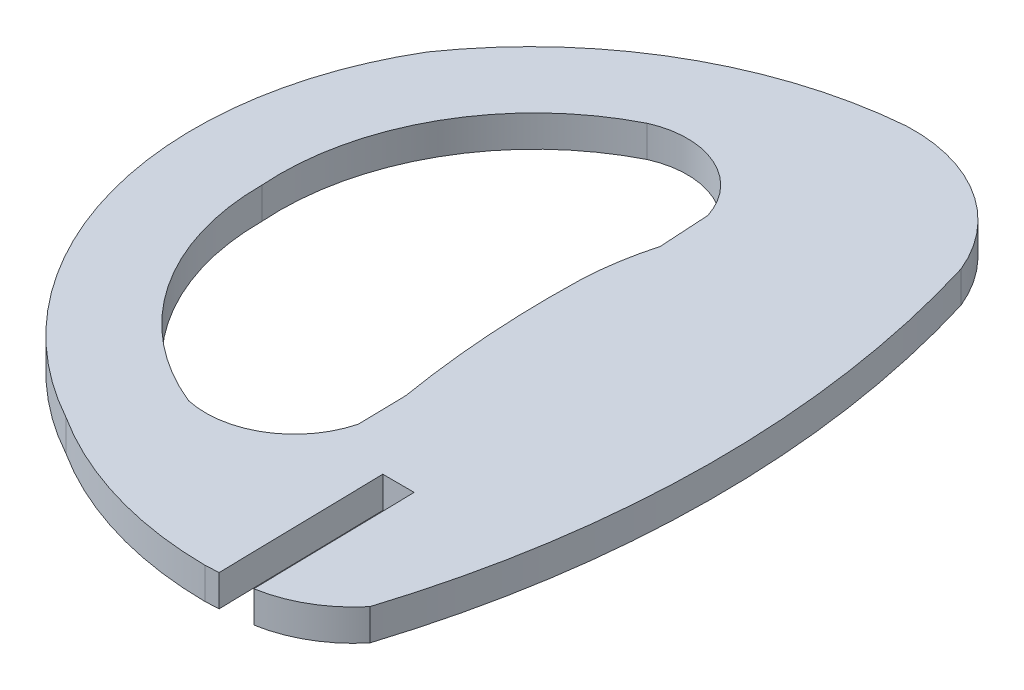
ISO-10303-21;
HEADER;
FILE_DESCRIPTION(('STEP AP214'),'2;1');
FILE_NAME('part.step','',(''),(''),'','','');
FILE_SCHEMA(('AUTOMOTIVE_DESIGN { 1 0 10303 214 1 1 1 1 }'));
ENDSEC;
DATA;
#1=APPLICATION_CONTEXT('core data for automotive mechanical design processes');
#2=APPLICATION_PROTOCOL_DEFINITION('international standard','automotive_design',2000,#1);
#3=PRODUCT_CONTEXT('',#1,'mechanical');
#4=PRODUCT('Part','Part','',(#3));
#5=PRODUCT_RELATED_PRODUCT_CATEGORY('part','',(#4));
#6=PRODUCT_DEFINITION_FORMATION('','',#4);
#7=PRODUCT_DEFINITION_CONTEXT('part definition',#1,'design');
#8=PRODUCT_DEFINITION('design','',#6,#7);
#9=PRODUCT_DEFINITION_SHAPE('','',#8);
#10=(LENGTH_UNIT() NAMED_UNIT(*) SI_UNIT(.MILLI.,.METRE.));
#11=(NAMED_UNIT(*) PLANE_ANGLE_UNIT() SI_UNIT($,.RADIAN.));
#12=(NAMED_UNIT(*) SI_UNIT($,.STERADIAN.) SOLID_ANGLE_UNIT());
#13=UNCERTAINTY_MEASURE_WITH_UNIT(LENGTH_MEASURE(1.E-05),#10,'distance_accuracy_value','');
#14=(GEOMETRIC_REPRESENTATION_CONTEXT(3) GLOBAL_UNCERTAINTY_ASSIGNED_CONTEXT((#13)) GLOBAL_UNIT_ASSIGNED_CONTEXT((#10,
#11,#12)) REPRESENTATION_CONTEXT('',''));
#15=CARTESIAN_POINT('',(0.,0.,0.));
#16=DIRECTION('',(0.,0.,1.));
#17=DIRECTION('',(1.,0.,0.));
#18=AXIS2_PLACEMENT_3D('',#15,#16,#17);
#19=CARTESIAN_POINT('',(-169.11361387481,2.,-647.611887756789));
#20=DIRECTION('',(0.,-1.,0.));
#21=DIRECTION('',(0.,0.,-1.));
#22=AXIS2_PLACEMENT_3D('',#19,#20,#21);
#23=CYLINDRICAL_SURFACE('',#22,7.77888442019999);
#24=CARTESIAN_POINT('',(-169.11361387481,0.,-647.611887756789));
#25=DIRECTION('',(0.,1.,0.));
#26=DIRECTION('',(0.,0.,1.));
#27=AXIS2_PLACEMENT_3D('',#24,#25,#26);
#28=CIRCLE('',#27,7.77888442019999);
#29=CARTESIAN_POINT('',(-167.8,0.,-639.94472));
#30=VERTEX_POINT('',#29);
#31=CARTESIAN_POINT('',(-163.118640000019,0.,-642.654940000013));
#32=VERTEX_POINT('',#31);
#33=EDGE_CURVE('E262',#30,#32,#28,.T.);
#34=ORIENTED_EDGE('',*,*,#33,.T.);
#35=DIRECTION('',(0.,-1.,0.));
#36=VECTOR('',#35,1.);
#37=CARTESIAN_POINT('',(-163.118640000019,2.,-642.654940000013));
#38=LINE('',#37,#36);
#39=CARTESIAN_POINT('',(-163.118640000019,2.,-642.654940000013));
#40=VERTEX_POINT('',#39);
#41=EDGE_CURVE('E288',#40,#32,#38,.T.);
#42=ORIENTED_EDGE('',*,*,#41,.F.);
#43=CARTESIAN_POINT('',(-169.11361387481,2.,-647.611887756789));
#44=DIRECTION('',(0.,1.,0.));
#45=DIRECTION('',(0.,0.,1.));
#46=AXIS2_PLACEMENT_3D('',#43,#44,#45);
#47=CIRCLE('',#46,7.77888442019999);
#48=CARTESIAN_POINT('',(-167.8,2.,-639.94472));
#49=VERTEX_POINT('',#48);
#50=EDGE_CURVE('E223',#49,#40,#47,.T.);
#51=ORIENTED_EDGE('',*,*,#50,.F.);
#52=DIRECTION('',(0.,-1.,0.));
#53=VECTOR('',#52,1.);
#54=CARTESIAN_POINT('',(-167.8,2.,-639.94472));
#55=LINE('',#54,#53);
#56=EDGE_CURVE('E246',#49,#30,#55,.T.);
#57=ORIENTED_EDGE('',*,*,#56,.T.);
#58=EDGE_LOOP('',(#34,#42,#51,#57));
#59=FACE_BOUND('',#58,.T.);
#60=ADVANCED_FACE('F37',(#59),#23,.T.);
#61=CARTESIAN_POINT('',(-223.341929986351,2.,-661.677782661367));
#62=DIRECTION('',(0.,-1.,0.));
#63=DIRECTION('',(0.,0.,-1.));
#64=AXIS2_PLACEMENT_3D('',#61,#62,#63);
#65=CYLINDRICAL_SURFACE('',#64,63.1562601782);
#66=CARTESIAN_POINT('',(-223.341929986351,0.,-661.677782661367));
#67=DIRECTION('',(0.,1.,0.));
#68=DIRECTION('',(0.,0.,1.));
#69=AXIS2_PLACEMENT_3D('',#66,#67,#68);
#70=CIRCLE('',#69,63.1562601782);
#71=CARTESIAN_POINT('',(-162.926399999944,0.,-680.080960000024));
#72=VERTEX_POINT('',#71);
#73=EDGE_CURVE('E260',#32,#72,#70,.T.);
#74=ORIENTED_EDGE('',*,*,#73,.T.);
#75=DIRECTION('',(0.,-1.,0.));
#76=VECTOR('',#75,1.);
#77=CARTESIAN_POINT('',(-162.926399999944,2.,-680.080960000024));
#78=LINE('',#77,#76);
#79=CARTESIAN_POINT('',(-162.926399999944,2.,-680.080960000024));
#80=VERTEX_POINT('',#79);
#81=EDGE_CURVE('E291',#80,#72,#78,.T.);
#82=ORIENTED_EDGE('',*,*,#81,.F.);
#83=CARTESIAN_POINT('',(-223.341929986351,2.,-661.677782661367));
#84=DIRECTION('',(0.,1.,0.));
#85=DIRECTION('',(0.,0.,1.));
#86=AXIS2_PLACEMENT_3D('',#83,#84,#85);
#87=CIRCLE('',#86,63.1562601782);
#88=EDGE_CURVE('E221',#40,#80,#87,.T.);
#89=ORIENTED_EDGE('',*,*,#88,.F.);
#90=ORIENTED_EDGE('',*,*,#41,.T.);
#91=EDGE_LOOP('',(#74,#82,#89,#90));
#92=FACE_BOUND('',#91,.T.);
#93=ADVANCED_FACE('F324',(#92),#65,.T.);
#94=CARTESIAN_POINT('',(-172.099934613147,2.,-676.291506564602));
#95=DIRECTION('',(0.,-1.,0.));
#96=DIRECTION('',(0.,0.,-1.));
#97=AXIS2_PLACEMENT_3D('',#94,#95,#96);
#98=CYLINDRICAL_SURFACE('',#97,9.9254065226);
#99=CARTESIAN_POINT('',(-172.099934613147,0.,-676.291506564602));
#100=DIRECTION('',(0.,1.,0.));
#101=DIRECTION('',(0.,0.,1.));
#102=AXIS2_PLACEMENT_3D('',#99,#100,#101);
#103=CIRCLE('',#102,9.9254065226);
#104=CARTESIAN_POINT('',(-172.532790000005,0.,-686.20747000004));
#105=VERTEX_POINT('',#104);
#106=EDGE_CURVE('E258',#72,#105,#103,.T.);
#107=ORIENTED_EDGE('',*,*,#106,.T.);
#108=DIRECTION('',(0.,-1.,0.));
#109=VECTOR('',#108,1.);
#110=CARTESIAN_POINT('',(-172.532790000005,2.,-686.20747000004));
#111=LINE('',#110,#109);
#112=CARTESIAN_POINT('',(-172.532790000005,2.,-686.20747000004));
#113=VERTEX_POINT('',#112);
#114=EDGE_CURVE('E294',#113,#105,#111,.T.);
#115=ORIENTED_EDGE('',*,*,#114,.F.);
#116=CARTESIAN_POINT('',(-172.099934613147,2.,-676.291506564602));
#117=DIRECTION('',(0.,1.,0.));
#118=DIRECTION('',(0.,0.,1.));
#119=AXIS2_PLACEMENT_3D('',#116,#117,#118);
#120=CIRCLE('',#119,9.9254065226);
#121=EDGE_CURVE('E219',#80,#113,#120,.T.);
#122=ORIENTED_EDGE('',*,*,#121,.F.);
#123=ORIENTED_EDGE('',*,*,#81,.T.);
#124=EDGE_LOOP('',(#107,#115,#122,#123));
#125=FACE_BOUND('',#124,.T.);
#126=ADVANCED_FACE('F345',(#125),#98,.T.);
#127=CARTESIAN_POINT('',(-170.324664374264,2.,-660.070363252052));
#128=DIRECTION('',(0.,-1.,0.));
#129=DIRECTION('',(0.,0.,-1.));
#130=AXIS2_PLACEMENT_3D('',#127,#128,#129);
#131=CYLINDRICAL_SURFACE('',#130,26.2302147901001);
#132=CARTESIAN_POINT('',(-170.324664374264,0.,-660.070363252052));
#133=DIRECTION('',(0.,1.,0.));
#134=DIRECTION('',(0.,0.,1.));
#135=AXIS2_PLACEMENT_3D('',#132,#133,#134);
#136=CIRCLE('',#135,26.2302147901001);
#137=CARTESIAN_POINT('',(-191.871880000025,0.,-675.028360000004));
#138=VERTEX_POINT('',#137);
#139=EDGE_CURVE('E256',#105,#138,#136,.T.);
#140=ORIENTED_EDGE('',*,*,#139,.T.);
#141=DIRECTION('',(0.,-1.,0.));
#142=VECTOR('',#141,1.);
#143=CARTESIAN_POINT('',(-191.871880000025,2.,-675.028360000004));
#144=LINE('',#143,#142);
#145=CARTESIAN_POINT('',(-191.871880000025,2.,-675.028360000004));
#146=VERTEX_POINT('',#145);
#147=EDGE_CURVE('E297',#146,#138,#144,.T.);
#148=ORIENTED_EDGE('',*,*,#147,.F.);
#149=CARTESIAN_POINT('',(-170.324664374264,2.,-660.070363252052));
#150=DIRECTION('',(0.,1.,0.));
#151=DIRECTION('',(0.,0.,1.));
#152=AXIS2_PLACEMENT_3D('',#149,#150,#151);
#153=CIRCLE('',#152,26.2302147901001);
#154=EDGE_CURVE('E217',#113,#146,#153,.T.);
#155=ORIENTED_EDGE('',*,*,#154,.F.);
#156=ORIENTED_EDGE('',*,*,#114,.T.);
#157=EDGE_LOOP('',(#140,#148,#155,#156));
#158=FACE_BOUND('',#157,.T.);
#159=ADVANCED_FACE('F351',(#158),#131,.T.);
#160=CARTESIAN_POINT('',(-172.229769955727,2.,-663.413189838115));
#161=DIRECTION('',(0.,-1.,0.));
#162=DIRECTION('',(0.,0.,-1.));
#163=AXIS2_PLACEMENT_3D('',#160,#161,#162);
#164=CYLINDRICAL_SURFACE('',#163,22.8193922987);
#165=CARTESIAN_POINT('',(-172.229769955727,0.,-663.413189838115));
#166=DIRECTION('',(0.,1.,0.));
#167=DIRECTION('',(0.,0.,1.));
#168=AXIS2_PLACEMENT_3D('',#165,#166,#167);
#169=CIRCLE('',#168,22.8193922987);
#170=CARTESIAN_POINT('',(-183.216719999999,0.,-643.412900000049));
#171=VERTEX_POINT('',#170);
#172=EDGE_CURVE('E254',#138,#171,#169,.T.);
#173=ORIENTED_EDGE('',*,*,#172,.T.);
#174=DIRECTION('',(0.,-1.,0.));
#175=VECTOR('',#174,1.);
#176=CARTESIAN_POINT('',(-183.216719999999,2.,-643.412900000049));
#177=LINE('',#176,#175);
#178=CARTESIAN_POINT('',(-183.216719999999,2.,-643.412900000049));
#179=VERTEX_POINT('',#178);
#180=EDGE_CURVE('E300',#179,#171,#177,.T.);
#181=ORIENTED_EDGE('',*,*,#180,.F.);
#182=CARTESIAN_POINT('',(-172.229769955727,2.,-663.413189838115));
#183=DIRECTION('',(0.,1.,0.));
#184=DIRECTION('',(0.,0.,1.));
#185=AXIS2_PLACEMENT_3D('',#182,#183,#184);
#186=CIRCLE('',#185,22.8193922987);
#187=EDGE_CURVE('E215',#146,#179,#186,.T.);
#188=ORIENTED_EDGE('',*,*,#187,.F.);
#189=ORIENTED_EDGE('',*,*,#147,.T.);
#190=EDGE_LOOP('',(#173,#181,#188,#189));
#191=FACE_BOUND('',#190,.T.);
#192=ADVANCED_FACE('F355',(#191),#164,.T.);
#193=CARTESIAN_POINT('',(-170.477037508952,2.,-663.324019262));
#194=DIRECTION('',(0.,-1.,0.));
#195=DIRECTION('',(0.,0.,-1.));
#196=AXIS2_PLACEMENT_3D('',#193,#194,#195);
#197=CYLINDRICAL_SURFACE('',#196,23.6379394245);
#198=CARTESIAN_POINT('',(-170.477037508952,0.,-663.324019262));
#199=DIRECTION('',(0.,1.,0.));
#200=DIRECTION('',(0.,0.,1.));
#201=AXIS2_PLACEMENT_3D('',#198,#199,#200);
#202=CIRCLE('',#201,23.6379394245);
#203=CARTESIAN_POINT('',(-170.639769999975,0.,-639.686640000062));
#204=VERTEX_POINT('',#203);
#205=EDGE_CURVE('E252',#171,#204,#202,.T.);
#206=ORIENTED_EDGE('',*,*,#205,.T.);
#207=DIRECTION('',(0.,-1.,0.));
#208=VECTOR('',#207,1.);
#209=CARTESIAN_POINT('',(-170.639769999975,2.,-639.686640000062));
#210=LINE('',#209,#208);
#211=CARTESIAN_POINT('',(-170.639769999975,2.,-639.686640000062));
#212=VERTEX_POINT('',#211);
#213=EDGE_CURVE('E303',#212,#204,#210,.T.);
#214=ORIENTED_EDGE('',*,*,#213,.F.);
#215=CARTESIAN_POINT('',(-170.477037508952,2.,-663.324019262));
#216=DIRECTION('',(0.,1.,0.));
#217=DIRECTION('',(0.,0.,1.));
#218=AXIS2_PLACEMENT_3D('',#215,#216,#217);
#219=CIRCLE('',#218,23.6379394245);
#220=EDGE_CURVE('E213',#179,#212,#219,.T.);
#221=ORIENTED_EDGE('',*,*,#220,.F.);
#222=ORIENTED_EDGE('',*,*,#180,.T.);
#223=EDGE_LOOP('',(#206,#214,#221,#222));
#224=FACE_BOUND('',#223,.T.);
#225=ADVANCED_FACE('F359',(#224),#197,.T.);
#226=CARTESIAN_POINT('',(-528.535637725332,2.,-619.566790581475));
#227=DIRECTION('',(-0.0561284257263486,0.,-0.99842355732699));
#228=DIRECTION('',(-0.99842355732699,0.,0.0561284257263486));
#229=AXIS2_PLACEMENT_3D('',#226,#227,#228);
#230=PLANE('',#229);
#231=DIRECTION('',(0.99842355732699,0.,-0.0561284257263486));
#232=VECTOR('',#231,1.);
#233=CARTESIAN_POINT('',(-528.535637725332,0.,-619.566790581475));
#234=LINE('',#233,#232);
#235=CARTESIAN_POINT('',(-169.79572,0.,-639.73409));
#236=VERTEX_POINT('',#235);
#237=EDGE_CURVE('E250',#204,#236,#234,.T.);
#238=ORIENTED_EDGE('',*,*,#237,.T.);
#239=DIRECTION('',(0.,-1.,0.));
#240=VECTOR('',#239,1.);
#241=CARTESIAN_POINT('',(-169.79572,2.,-639.73409));
#242=LINE('',#241,#240);
#243=CARTESIAN_POINT('',(-169.79572,2.,-639.73409));
#244=VERTEX_POINT('',#243);
#245=EDGE_CURVE('E306',#244,#236,#242,.T.);
#246=ORIENTED_EDGE('',*,*,#245,.F.);
#247=DIRECTION('',(0.99842355732699,0.,-0.0561284257263486));
#248=VECTOR('',#247,1.);
#249=CARTESIAN_POINT('',(-528.535637725332,2.,-619.566790581475));
#250=LINE('',#249,#248);
#251=EDGE_CURVE('E211',#212,#244,#250,.T.);
#252=ORIENTED_EDGE('',*,*,#251,.F.);
#253=ORIENTED_EDGE('',*,*,#213,.T.);
#254=EDGE_LOOP('',(#238,#246,#252,#253));
#255=FACE_BOUND('',#254,.T.);
#256=ADVANCED_FACE('F363',(#255),#230,.F.);
#257=CARTESIAN_POINT('',(-168.58984963814,2.,-579.270044210389));
#258=DIRECTION('',(-0.999801185841762,0.,0.019939628617544));
#259=DIRECTION('',(0.019939628617544,0.,0.999801185841763));
#260=AXIS2_PLACEMENT_3D('',#257,#258,#259);
#261=PLANE('',#260);
#262=DIRECTION('',(-0.019939628617544,0.,-0.999801185841763));
#263=VECTOR('',#262,1.);
#264=CARTESIAN_POINT('',(-168.58984963814,0.,-579.270044210389));
#265=LINE('',#264,#263);
#266=CARTESIAN_POINT('',(-170.00765,0.,-650.36056));
#267=VERTEX_POINT('',#266);
#268=EDGE_CURVE('E243',#236,#267,#265,.T.);
#269=ORIENTED_EDGE('',*,*,#268,.T.);
#270=DIRECTION('',(0.,-1.,0.));
#271=VECTOR('',#270,1.);
#272=CARTESIAN_POINT('',(-170.00765,2.,-650.36056));
#273=LINE('',#272,#271);
#274=CARTESIAN_POINT('',(-170.00765,2.,-650.36056));
#275=VERTEX_POINT('',#274);
#276=EDGE_CURVE('E309',#275,#267,#273,.T.);
#277=ORIENTED_EDGE('',*,*,#276,.F.);
#278=DIRECTION('',(-0.019939628617544,0.,-0.999801185841763));
#279=VECTOR('',#278,1.);
#280=CARTESIAN_POINT('',(-168.58984963814,2.,-579.270044210389));
#281=LINE('',#280,#279);
#282=EDGE_CURVE('E209',#244,#275,#281,.T.);
#283=ORIENTED_EDGE('',*,*,#282,.F.);
#284=ORIENTED_EDGE('',*,*,#245,.T.);
#285=EDGE_LOOP('',(#269,#277,#283,#284));
#286=FACE_BOUND('',#285,.T.);
#287=ADVANCED_FACE('F367',(#286),#261,.F.);
#288=CARTESIAN_POINT('',(-525.70352169724,2.,-651.109120155476));
#289=DIRECTION('',(0.00210449026091129,0.,-0.999997785557919));
#290=DIRECTION('',(-0.999997785557919,0.,-0.00210449026091129));
#291=AXIS2_PLACEMENT_3D('',#288,#289,#290);
#292=PLANE('',#291);
#293=DIRECTION('',(0.999997785557919,0.,0.00210449026091129));
#294=VECTOR('',#293,1.);
#295=CARTESIAN_POINT('',(-525.70352169724,0.,-651.109120155476));
#296=LINE('',#295,#294);
#297=CARTESIAN_POINT('',(-168.00717,0.,-650.35635));
#298=VERTEX_POINT('',#297);
#299=EDGE_CURVE('E241',#267,#298,#296,.T.);
#300=ORIENTED_EDGE('',*,*,#299,.T.);
#301=DIRECTION('',(0.,-1.,0.));
#302=VECTOR('',#301,1.);
#303=CARTESIAN_POINT('',(-168.00717,2.,-650.35635));
#304=LINE('',#303,#302);
#305=CARTESIAN_POINT('',(-168.00717,2.,-650.35635));
#306=VERTEX_POINT('',#305);
#307=EDGE_CURVE('E311',#306,#298,#304,.T.);
#308=ORIENTED_EDGE('',*,*,#307,.F.);
#309=DIRECTION('',(0.999997785557919,0.,0.00210449026091129));
#310=VECTOR('',#309,1.);
#311=CARTESIAN_POINT('',(-525.70352169724,2.,-651.109120155476));
#312=LINE('',#311,#310);
#313=EDGE_CURVE('E206',#275,#306,#312,.T.);
#314=ORIENTED_EDGE('',*,*,#313,.F.);
#315=ORIENTED_EDGE('',*,*,#276,.T.);
#316=EDGE_LOOP('',(#300,#308,#314,#315));
#317=FACE_BOUND('',#316,.T.);
#318=ADVANCED_FACE('F370',(#317),#292,.F.);
#319=CARTESIAN_POINT('',(-169.109262305325,2.,-593.129987009089));
#320=DIRECTION('',(-0.998274458669148,0.,0.0587205685328305));
#321=DIRECTION('',(0.0587205685328305,0.,0.998274458669148));
#322=AXIS2_PLACEMENT_3D('',#319,#320,#321);
#323=PLANE('',#322);
#324=DIRECTION('',(-0.0587205685328305,0.,-0.998274458669148));
#325=VECTOR('',#324,1.);
#326=CARTESIAN_POINT('',(-169.109262305325,0.,-593.129987009089));
#327=LINE('',#326,#325);
#328=CARTESIAN_POINT('',(-173.73276,0.,-671.7314));
#329=VERTEX_POINT('',#328);
#330=CARTESIAN_POINT('',(-173.92223,0.,-674.95247));
#331=VERTEX_POINT('',#330);
#332=EDGE_CURVE('E11',#329,#331,#327,.T.);
#333=ORIENTED_EDGE('',*,*,#332,.F.);
#334=DIRECTION('',(0.,-1.,0.));
#335=VECTOR('',#334,1.);
#336=CARTESIAN_POINT('',(-173.73276,2.,-671.7314));
#337=LINE('',#336,#335);
#338=CARTESIAN_POINT('',(-173.73276,2.,-671.7314));
#339=VERTEX_POINT('',#338);
#340=EDGE_CURVE('E56',#339,#329,#337,.T.);
#341=ORIENTED_EDGE('',*,*,#340,.F.);
#342=DIRECTION('',(-0.0587205685328305,0.,-0.998274458669148));
#343=VECTOR('',#342,1.);
#344=CARTESIAN_POINT('',(-169.109262305325,2.,-593.129987009089));
#345=LINE('',#344,#343);
#346=CARTESIAN_POINT('',(-173.92223,2.,-674.95247));
#347=VERTEX_POINT('',#346);
#348=EDGE_CURVE('E41',#339,#347,#345,.T.);
#349=ORIENTED_EDGE('',*,*,#348,.T.);
#350=DIRECTION('',(0.,-1.,0.));
#351=VECTOR('',#350,1.);
#352=CARTESIAN_POINT('',(-173.92223,2.,-674.95247));
#353=LINE('',#352,#351);
#354=EDGE_CURVE('E207',#347,#331,#353,.T.);
#355=ORIENTED_EDGE('',*,*,#354,.T.);
#356=EDGE_LOOP('',(#333,#341,#349,#355));
#357=FACE_BOUND('',#356,.T.);
#358=ADVANCED_FACE('F373',(#357),#323,.T.);
#359=CARTESIAN_POINT('',(-155.351377950387,2.,-666.552062661288));
#360=DIRECTION('',(0.,-1.,0.));
#361=DIRECTION('',(0.,0.,-1.));
#362=AXIS2_PLACEMENT_3D('',#359,#360,#361);
#363=CYLINDRICAL_SURFACE('',#362,19.097139611);
#364=CARTESIAN_POINT('',(-155.351377950387,0.,-666.552062661288));
#365=DIRECTION('',(0.,1.,0.));
#366=DIRECTION('',(0.,0.,1.));
#367=AXIS2_PLACEMENT_3D('',#364,#365,#366);
#368=CIRCLE('',#367,19.097139611);
#369=CARTESIAN_POINT('',(-174.428029999934,0.,-667.436419999989));
#370=VERTEX_POINT('',#369);
#371=EDGE_CURVE('E47',#329,#370,#368,.T.);
#372=ORIENTED_EDGE('',*,*,#371,.T.);
#373=DIRECTION('',(0.,-1.,0.));
#374=VECTOR('',#373,1.);
#375=CARTESIAN_POINT('',(-174.428029999934,2.,-667.436419999989));
#376=LINE('',#375,#374);
#377=CARTESIAN_POINT('',(-174.428029999934,2.,-667.436419999989));
#378=VERTEX_POINT('',#377);
#379=EDGE_CURVE('E185',#378,#370,#376,.T.);
#380=ORIENTED_EDGE('',*,*,#379,.F.);
#381=CARTESIAN_POINT('',(-155.351377950387,2.,-666.552062661288));
#382=DIRECTION('',(0.,1.,0.));
#383=DIRECTION('',(0.,0.,1.));
#384=AXIS2_PLACEMENT_3D('',#381,#382,#383);
#385=CIRCLE('',#384,19.097139611);
#386=EDGE_CURVE('E113',#339,#378,#385,.T.);
#387=ORIENTED_EDGE('',*,*,#386,.F.);
#388=ORIENTED_EDGE('',*,*,#340,.T.);
#389=EDGE_LOOP('',(#372,#380,#387,#388));
#390=FACE_BOUND('',#389,.T.);
#391=ADVANCED_FACE('F378',(#390),#363,.T.);
#392=CARTESIAN_POINT('',(-112.595118830434,2.,-665.641472917661));
#393=DIRECTION('',(0.,-1.,0.));
#394=DIRECTION('',(0.,0.,-1.));
#395=AXIS2_PLACEMENT_3D('',#392,#393,#394);
#396=CYLINDRICAL_SURFACE('',#395,61.8589584354904);
#397=CARTESIAN_POINT('',(-112.595118830434,0.,-665.641472917661));
#398=DIRECTION('',(0.,1.,0.));
#399=DIRECTION('',(0.,0.,1.));
#400=AXIS2_PLACEMENT_3D('',#397,#398,#399);
#401=CIRCLE('',#400,61.8589584354904);
#402=CARTESIAN_POINT('',(-173.60645,0.,-655.43617));
#403=VERTEX_POINT('',#402);
#404=EDGE_CURVE('E189',#370,#403,#401,.T.);
#405=ORIENTED_EDGE('',*,*,#404,.T.);
#406=DIRECTION('',(0.,-1.,0.));
#407=VECTOR('',#406,1.);
#408=CARTESIAN_POINT('',(-173.60645,2.,-655.43617));
#409=LINE('',#408,#407);
#410=CARTESIAN_POINT('',(-173.60645,2.,-655.43617));
#411=VERTEX_POINT('',#410);
#412=EDGE_CURVE('E174',#411,#403,#409,.T.);
#413=ORIENTED_EDGE('',*,*,#412,.F.);
#414=CARTESIAN_POINT('',(-112.595118830434,2.,-665.641472917661));
#415=DIRECTION('',(0.,1.,0.));
#416=DIRECTION('',(0.,0.,1.));
#417=AXIS2_PLACEMENT_3D('',#414,#415,#416);
#418=CIRCLE('',#417,61.8589584354904);
#419=EDGE_CURVE('E239',#378,#411,#418,.T.);
#420=ORIENTED_EDGE('',*,*,#419,.F.);
#421=ORIENTED_EDGE('',*,*,#379,.T.);
#422=EDGE_LOOP('',(#405,#413,#420,#421));
#423=FACE_BOUND('',#422,.T.);
#424=ADVANCED_FACE('F190',(#423),#396,.T.);
#425=CARTESIAN_POINT('',(-172.053911239225,2.,-579.36570375622));
#426=DIRECTION('',(-0.999791796942596,0.,0.0204049691569366));
#427=DIRECTION('',(0.0204049691569366,0.,0.999791796942596));
#428=AXIS2_PLACEMENT_3D('',#425,#426,#427);
#429=PLANE('',#428);
#430=DIRECTION('',(-0.0204049691569366,0.,-0.999791796942596));
#431=VECTOR('',#430,1.);
#432=CARTESIAN_POINT('',(-172.053911239225,0.,-579.36570375622));
#433=LINE('',#432,#431);
#434=CARTESIAN_POINT('',(-173.543289999944,0.,-652.341489999975));
#435=VERTEX_POINT('',#434);
#436=EDGE_CURVE('E178',#435,#403,#433,.T.);
#437=ORIENTED_EDGE('',*,*,#436,.F.);
#438=DIRECTION('',(0.,-1.,0.));
#439=VECTOR('',#438,1.);
#440=CARTESIAN_POINT('',(-173.543289999944,2.,-652.341489999975));
#441=LINE('',#440,#439);
#442=CARTESIAN_POINT('',(-173.543289999944,2.,-652.341489999975));
#443=VERTEX_POINT('',#442);
#444=EDGE_CURVE('E184',#443,#435,#441,.T.);
#445=ORIENTED_EDGE('',*,*,#444,.F.);
#446=DIRECTION('',(-0.0204049691569366,0.,-0.999791796942596));
#447=VECTOR('',#446,1.);
#448=CARTESIAN_POINT('',(-172.053911239225,2.,-579.36570375622));
#449=LINE('',#448,#447);
#450=EDGE_CURVE('E181',#443,#411,#449,.T.);
#451=ORIENTED_EDGE('',*,*,#450,.T.);
#452=ORIENTED_EDGE('',*,*,#412,.T.);
#453=EDGE_LOOP('',(#437,#445,#451,#452));
#454=FACE_BOUND('',#453,.T.);
#455=ADVANCED_FACE('F176',(#454),#429,.T.);
#456=CARTESIAN_POINT('',(-179.00989963589,2.,-653.74338022314));
#457=DIRECTION('',(0.,-1.,0.));
#458=DIRECTION('',(0.,0.,-1.));
#459=AXIS2_PLACEMENT_3D('',#456,#457,#458);
#460=CYLINDRICAL_SURFACE('',#459,5.64350220249997);
#461=CARTESIAN_POINT('',(-179.00989963589,0.,-653.74338022314));
#462=DIRECTION('',(0.,1.,0.));
#463=DIRECTION('',(0.,0.,1.));
#464=AXIS2_PLACEMENT_3D('',#461,#462,#463);
#465=CIRCLE('',#464,5.64350220249997);
#466=CARTESIAN_POINT('',(-180.242280000049,0.,-648.236080000012));
#467=VERTEX_POINT('',#466);
#468=EDGE_CURVE('E197',#467,#435,#465,.T.);
#469=ORIENTED_EDGE('',*,*,#468,.F.);
#470=DIRECTION('',(0.,-1.,0.));
#471=VECTOR('',#470,1.);
#472=CARTESIAN_POINT('',(-180.242280000049,2.,-648.236080000012));
#473=LINE('',#472,#471);
#474=CARTESIAN_POINT('',(-180.242280000049,2.,-648.236080000012));
#475=VERTEX_POINT('',#474);
#476=EDGE_CURVE('E276',#475,#467,#473,.T.);
#477=ORIENTED_EDGE('',*,*,#476,.F.);
#478=CARTESIAN_POINT('',(-179.00989963589,2.,-653.74338022314));
#479=DIRECTION('',(0.,1.,0.));
#480=DIRECTION('',(0.,0.,1.));
#481=AXIS2_PLACEMENT_3D('',#478,#479,#480);
#482=CIRCLE('',#481,5.64350220249997);
#483=EDGE_CURVE('E235',#475,#443,#482,.T.);
#484=ORIENTED_EDGE('',*,*,#483,.T.);
#485=ORIENTED_EDGE('',*,*,#444,.T.);
#486=EDGE_LOOP('',(#469,#477,#484,#485));
#487=FACE_BOUND('',#486,.T.);
#488=ADVANCED_FACE('F280',(#487),#460,.F.);
#489=CARTESIAN_POINT('',(-174.500378713827,2.,-662.401808084771));
#490=DIRECTION('',(0.,-1.,0.));
#491=DIRECTION('',(0.,0.,-1.));
#492=AXIS2_PLACEMENT_3D('',#489,#490,#491);
#493=CYLINDRICAL_SURFACE('',#492,15.2851981522);
#494=CARTESIAN_POINT('',(-174.500378713827,0.,-662.401808084771));
#495=DIRECTION('',(0.,1.,0.));
#496=DIRECTION('',(0.,0.,1.));
#497=AXIS2_PLACEMENT_3D('',#494,#495,#496);
#498=CIRCLE('',#497,15.2851981522);
#499=CARTESIAN_POINT('',(-189.785509999974,0.,-662.447020000007));
#500=VERTEX_POINT('',#499);
#501=EDGE_CURVE('E199',#500,#467,#498,.T.);
#502=ORIENTED_EDGE('',*,*,#501,.F.);
#503=DIRECTION('',(0.,-1.,0.));
#504=VECTOR('',#503,1.);
#505=CARTESIAN_POINT('',(-189.785509999974,2.,-662.447020000007));
#506=LINE('',#505,#504);
#507=CARTESIAN_POINT('',(-189.785509999974,2.,-662.447020000007));
#508=VERTEX_POINT('',#507);
#509=EDGE_CURVE('E274',#508,#500,#506,.T.);
#510=ORIENTED_EDGE('',*,*,#509,.F.);
#511=CARTESIAN_POINT('',(-174.500378713827,2.,-662.401808084771));
#512=DIRECTION('',(0.,1.,0.));
#513=DIRECTION('',(0.,0.,1.));
#514=AXIS2_PLACEMENT_3D('',#511,#512,#513);
#515=CIRCLE('',#514,15.2851981522);
#516=EDGE_CURVE('E232',#508,#475,#515,.T.);
#517=ORIENTED_EDGE('',*,*,#516,.T.);
#518=ORIENTED_EDGE('',*,*,#476,.T.);
#519=EDGE_LOOP('',(#502,#510,#517,#518));
#520=FACE_BOUND('',#519,.T.);
#521=ADVANCED_FACE('F273',(#520),#493,.F.);
#522=CARTESIAN_POINT('',(-173.609466368602,2.,-663.640126428531));
#523=DIRECTION('',(0.,-1.,0.));
#524=DIRECTION('',(0.,0.,-1.));
#525=AXIS2_PLACEMENT_3D('',#522,#523,#524);
#526=CYLINDRICAL_SURFACE('',#525,16.2199842945);
#527=CARTESIAN_POINT('',(-173.609466368602,0.,-663.640126428531));
#528=DIRECTION('',(0.,1.,0.));
#529=DIRECTION('',(0.,0.,1.));
#530=AXIS2_PLACEMENT_3D('',#527,#528,#529);
#531=CIRCLE('',#530,16.2199842945);
#532=CARTESIAN_POINT('',(-180.937549999974,0.,-678.110340000053));
#533=VERTEX_POINT('',#532);
#534=EDGE_CURVE('E268',#533,#500,#531,.T.);
#535=ORIENTED_EDGE('',*,*,#534,.F.);
#536=DIRECTION('',(0.,-1.,0.));
#537=VECTOR('',#536,1.);
#538=CARTESIAN_POINT('',(-180.937549999974,2.,-678.110340000053));
#539=LINE('',#538,#537);
#540=CARTESIAN_POINT('',(-180.937549999974,2.,-678.110340000053));
#541=VERTEX_POINT('',#540);
#542=EDGE_CURVE('E285',#541,#533,#539,.T.);
#543=ORIENTED_EDGE('',*,*,#542,.F.);
#544=CARTESIAN_POINT('',(-173.609466368602,2.,-663.640126428531));
#545=DIRECTION('',(0.,1.,0.));
#546=DIRECTION('',(0.,0.,1.));
#547=AXIS2_PLACEMENT_3D('',#544,#545,#546);
#548=CIRCLE('',#547,16.2199842945);
#549=EDGE_CURVE('E229',#541,#508,#548,.T.);
#550=ORIENTED_EDGE('',*,*,#549,.T.);
#551=ORIENTED_EDGE('',*,*,#509,.T.);
#552=EDGE_LOOP('',(#535,#543,#550,#551));
#553=FACE_BOUND('',#552,.T.);
#554=ADVANCED_FACE('F336',(#553),#526,.F.);
#555=CARTESIAN_POINT('',(-178.838468002551,2.,-673.402199100877));
#556=DIRECTION('',(0.,-1.,0.));
#557=DIRECTION('',(0.,0.,-1.));
#558=AXIS2_PLACEMENT_3D('',#555,#556,#557);
#559=CYLINDRICAL_SURFACE('',#558,5.1548749702);
#560=CARTESIAN_POINT('',(-178.838468002551,0.,-673.402199100877));
#561=DIRECTION('',(0.,1.,0.));
#562=DIRECTION('',(0.,0.,1.));
#563=AXIS2_PLACEMENT_3D('',#560,#561,#562);
#564=CIRCLE('',#563,5.1548749702);
#565=EDGE_CURVE('E265',#331,#533,#564,.T.);
#566=ORIENTED_EDGE('',*,*,#565,.F.);
#567=ORIENTED_EDGE('',*,*,#354,.F.);
#568=CARTESIAN_POINT('',(-178.838468002551,2.,-673.402199100877));
#569=DIRECTION('',(0.,1.,0.));
#570=DIRECTION('',(0.,0.,1.));
#571=AXIS2_PLACEMENT_3D('',#568,#569,#570);
#572=CIRCLE('',#571,5.1548749702);
#573=EDGE_CURVE('E226',#347,#541,#572,.T.);
#574=ORIENTED_EDGE('',*,*,#573,.T.);
#575=ORIENTED_EDGE('',*,*,#542,.T.);
#576=EDGE_LOOP('',(#566,#567,#574,#575));
#577=FACE_BOUND('',#576,.T.);
#578=ADVANCED_FACE('F330',(#577),#559,.F.);
#579=CARTESIAN_POINT('',(-166.593164870618,2.,-579.293463359896));
#580=DIRECTION('',(0.999802094736183,0.,-0.0198940031451849));
#581=DIRECTION('',(-0.0198940031451849,0.,-0.999802094736183));
#582=AXIS2_PLACEMENT_3D('',#579,#580,#581);
#583=PLANE('',#582);
#584=DIRECTION('',(0.0198940031451849,0.,0.999802094736183));
#585=VECTOR('',#584,1.);
#586=CARTESIAN_POINT('',(-166.593164870618,0.,-579.293463359896));
#587=LINE('',#586,#585);
#588=EDGE_CURVE('E126',#298,#30,#587,.T.);
#589=ORIENTED_EDGE('',*,*,#588,.T.);
#590=ORIENTED_EDGE('',*,*,#56,.F.);
#591=DIRECTION('',(0.0198940031451849,0.,0.999802094736183));
#592=VECTOR('',#591,1.);
#593=CARTESIAN_POINT('',(-166.593164870618,2.,-579.293463359896));
#594=LINE('',#593,#592);
#595=EDGE_CURVE('E204',#306,#49,#594,.T.);
#596=ORIENTED_EDGE('',*,*,#595,.F.);
#597=ORIENTED_EDGE('',*,*,#307,.T.);
#598=EDGE_LOOP('',(#589,#590,#596,#597));
#599=FACE_BOUND('',#598,.T.);
#600=ADVANCED_FACE('F328',(#599),#583,.F.);
#601=CARTESIAN_POINT('',(-525.869702128861,2.,-572.1446));
#602=DIRECTION('',(0.,1.,0.));
#603=DIRECTION('',(0.,0.,1.));
#604=AXIS2_PLACEMENT_3D('',#601,#602,#603);
#605=PLANE('',#604);
#606=ORIENTED_EDGE('',*,*,#348,.F.);
#607=ORIENTED_EDGE('',*,*,#386,.T.);
#608=ORIENTED_EDGE('',*,*,#419,.T.);
#609=ORIENTED_EDGE('',*,*,#450,.F.);
#610=ORIENTED_EDGE('',*,*,#483,.F.);
#611=ORIENTED_EDGE('',*,*,#516,.F.);
#612=ORIENTED_EDGE('',*,*,#549,.F.);
#613=ORIENTED_EDGE('',*,*,#573,.F.);
#614=EDGE_LOOP('',(#606,#607,#608,#609,#610,#611,#612,#613));
#615=FACE_BOUND('',#614,.T.);
#616=ORIENTED_EDGE('',*,*,#50,.T.);
#617=ORIENTED_EDGE('',*,*,#88,.T.);
#618=ORIENTED_EDGE('',*,*,#121,.T.);
#619=ORIENTED_EDGE('',*,*,#154,.T.);
#620=ORIENTED_EDGE('',*,*,#187,.T.);
#621=ORIENTED_EDGE('',*,*,#220,.T.);
#622=ORIENTED_EDGE('',*,*,#251,.T.);
#623=ORIENTED_EDGE('',*,*,#282,.T.);
#624=ORIENTED_EDGE('',*,*,#313,.T.);
#625=ORIENTED_EDGE('',*,*,#595,.T.);
#626=EDGE_LOOP('',(#616,#617,#618,#619,#620,#621,#622,#623,#624,#625));
#627=FACE_BOUND('',#626,.T.);
#628=ADVANCED_FACE('F39',(#615,#627),#605,.T.);
#629=CARTESIAN_POINT('',(-525.869702128861,0.,-572.1446));
#630=DIRECTION('',(0.,1.,0.));
#631=DIRECTION('',(0.,0.,1.));
#632=AXIS2_PLACEMENT_3D('',#629,#630,#631);
#633=PLANE('',#632);
#634=ORIENTED_EDGE('',*,*,#332,.T.);
#635=ORIENTED_EDGE('',*,*,#565,.T.);
#636=ORIENTED_EDGE('',*,*,#534,.T.);
#637=ORIENTED_EDGE('',*,*,#501,.T.);
#638=ORIENTED_EDGE('',*,*,#468,.T.);
#639=ORIENTED_EDGE('',*,*,#436,.T.);
#640=ORIENTED_EDGE('',*,*,#404,.F.);
#641=ORIENTED_EDGE('',*,*,#371,.F.);
#642=EDGE_LOOP('',(#634,#635,#636,#637,#638,#639,#640,#641));
#643=FACE_BOUND('',#642,.T.);
#644=ORIENTED_EDGE('',*,*,#33,.F.);
#645=ORIENTED_EDGE('',*,*,#588,.F.);
#646=ORIENTED_EDGE('',*,*,#299,.F.);
#647=ORIENTED_EDGE('',*,*,#268,.F.);
#648=ORIENTED_EDGE('',*,*,#237,.F.);
#649=ORIENTED_EDGE('',*,*,#205,.F.);
#650=ORIENTED_EDGE('',*,*,#172,.F.);
#651=ORIENTED_EDGE('',*,*,#139,.F.);
#652=ORIENTED_EDGE('',*,*,#106,.F.);
#653=ORIENTED_EDGE('',*,*,#73,.F.);
#654=EDGE_LOOP('',(#644,#645,#646,#647,#648,#649,#650,#651,#652,#653));
#655=FACE_BOUND('',#654,.T.);
#656=ADVANCED_FACE('F193',(#643,#655),#633,.F.);
#657=CLOSED_SHELL('',(#60,#93,#126,#159,#192,#225,#256,#287,#318,#358,#391,#424,#455,#488,#521,
#554,#578,#600,#628,#656));
#658=MANIFOLD_SOLID_BREP('B2',#657);
#659=ADVANCED_BREP_SHAPE_REPRESENTATION('',(#18,#658),#14);
#660=SHAPE_DEFINITION_REPRESENTATION(#9,#659);
ENDSEC;
END-ISO-10303-21;
